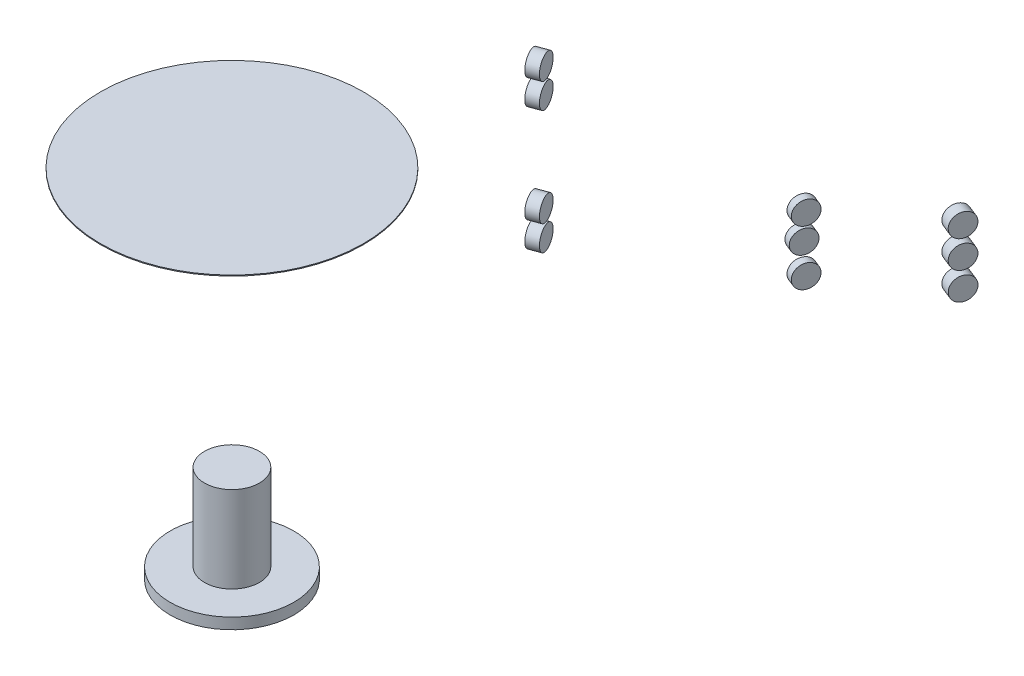
ISO-10303-21;
HEADER;
FILE_DESCRIPTION(('STEP AP214'),'2;1');
FILE_NAME('part.step','',(''),(''),'','','');
FILE_SCHEMA(('AUTOMOTIVE_DESIGN { 1 0 10303 214 1 1 1 1 }'));
ENDSEC;
DATA;
#1=APPLICATION_CONTEXT('core data for automotive mechanical design processes');
#2=APPLICATION_PROTOCOL_DEFINITION('international standard','automotive_design',2000,#1);
#3=PRODUCT_CONTEXT('',#1,'mechanical');
#4=PRODUCT('Part','Part','',(#3));
#5=PRODUCT_RELATED_PRODUCT_CATEGORY('part','',(#4));
#6=PRODUCT_DEFINITION_FORMATION('','',#4);
#7=PRODUCT_DEFINITION_CONTEXT('part definition',#1,'design');
#8=PRODUCT_DEFINITION('design','',#6,#7);
#9=PRODUCT_DEFINITION_SHAPE('','',#8);
#10=(LENGTH_UNIT() NAMED_UNIT(*) SI_UNIT(.MILLI.,.METRE.));
#11=(NAMED_UNIT(*) PLANE_ANGLE_UNIT() SI_UNIT($,.RADIAN.));
#12=(NAMED_UNIT(*) SI_UNIT($,.STERADIAN.) SOLID_ANGLE_UNIT());
#13=UNCERTAINTY_MEASURE_WITH_UNIT(LENGTH_MEASURE(1.E-05),#10,'distance_accuracy_value','');
#14=(GEOMETRIC_REPRESENTATION_CONTEXT(3) GLOBAL_UNCERTAINTY_ASSIGNED_CONTEXT((#13)) GLOBAL_UNIT_ASSIGNED_CONTEXT((#10,
#11,#12)) REPRESENTATION_CONTEXT('',''));
#15=CARTESIAN_POINT('',(0.,0.,0.));
#16=DIRECTION('',(0.,0.,1.));
#17=DIRECTION('',(1.,0.,0.));
#18=AXIS2_PLACEMENT_3D('',#15,#16,#17);
#19=CARTESIAN_POINT('',(562.010357181863,0.,680.173515638492));
#20=DIRECTION('',(0.92880687950673,0.,0.37056413828239));
#21=DIRECTION('',(0.343581086096886,-0.374606593415913,-0.8611747426892));
#22=AXIS2_PLACEMENT_3D('',#19,#20,#21);
#23=CYLINDRICAL_SURFACE('',#22,25.);
#24=CARTESIAN_POINT('',(562.010357181863,0.,680.173515638492));
#25=DIRECTION('',(-0.92880687950673,0.,-0.37056413828239));
#26=DIRECTION('',(0.138815769484069,0.927183854566787,-0.34793718107328));
#27=AXIS2_PLACEMENT_3D('',#24,#25,#26);
#28=CIRCLE('',#27,25.);
#29=CARTESIAN_POINT('',(565.480751418965,23.1795963641697,671.47508611166));
#30=VERTEX_POINT('',#29);
#31=EDGE_CURVE('E27',#30,#30,#28,.T.);
#32=ORIENTED_EDGE('',*,*,#31,.F.);
#33=EDGE_LOOP('',(#32));
#34=FACE_BOUND('',#33,.T.);
#35=CARTESIAN_POINT('',(585.230529169531,0.,689.437619095551));
#36=DIRECTION('',(-0.92880687950673,0.,-0.37056413828239));
#37=DIRECTION('',(0.138815769484069,0.927183854566787,-0.34793718107328));
#38=AXIS2_PLACEMENT_3D('',#35,#36,#37);
#39=CIRCLE('',#38,25.);
#40=CARTESIAN_POINT('',(588.700923406633,23.1795963641697,680.739189568719));
#41=VERTEX_POINT('',#40);
#42=EDGE_CURVE('E34',#41,#41,#39,.T.);
#43=ORIENTED_EDGE('',*,*,#42,.T.);
#44=EDGE_LOOP('',(#43));
#45=FACE_BOUND('',#44,.T.);
#46=ADVANCED_FACE('F132',(#34,#45),#23,.T.);
#47=CARTESIAN_POINT('',(562.010357181863,0.,680.173515638492));
#48=DIRECTION('',(-0.92880687950673,0.,-0.37056413828239));
#49=DIRECTION('',(-0.343581086096886,0.374606593415913,0.8611747426892));
#50=AXIS2_PLACEMENT_3D('',#47,#48,#49);
#51=PLANE('',#50);
#52=ORIENTED_EDGE('',*,*,#31,.T.);
#53=EDGE_LOOP('',(#52));
#54=FACE_BOUND('',#53,.T.);
#55=ADVANCED_FACE('F276',(#54),#51,.T.);
#56=CARTESIAN_POINT('',(585.230529169531,0.,689.437619095551));
#57=DIRECTION('',(-0.92880687950673,0.,-0.37056413828239));
#58=DIRECTION('',(-0.343581086096886,0.374606593415913,0.8611747426892));
#59=AXIS2_PLACEMENT_3D('',#56,#57,#58);
#60=PLANE('',#59);
#61=ORIENTED_EDGE('',*,*,#42,.F.);
#62=EDGE_LOOP('',(#61));
#63=FACE_BOUND('',#62,.T.);
#64=ADVANCED_FACE('F274',(#63),#60,.F.);
#65=CLOSED_SHELL('',(#46,#55,#64));
#66=MANIFOLD_SOLID_BREP('B1',#65);
#67=CARTESIAN_POINT('',(562.010357181863,60.,680.173515638492));
#68=DIRECTION('',(0.92880687950673,0.,0.37056413828239));
#69=DIRECTION('',(0.343581086096886,-0.374606593415913,-0.8611747426892));
#70=AXIS2_PLACEMENT_3D('',#67,#68,#69);
#71=CYLINDRICAL_SURFACE('',#70,25.);
#72=CARTESIAN_POINT('',(562.010357181863,60.,680.173515638492));
#73=DIRECTION('',(-0.92880687950673,0.,-0.37056413828239));
#74=DIRECTION('',(0.138815769484069,0.927183854566787,-0.34793718107328));
#75=AXIS2_PLACEMENT_3D('',#72,#73,#74);
#76=CIRCLE('',#75,25.);
#77=CARTESIAN_POINT('',(565.480751418965,83.1795963641697,671.47508611166));
#78=VERTEX_POINT('',#77);
#79=EDGE_CURVE('E40',#78,#78,#76,.T.);
#80=ORIENTED_EDGE('',*,*,#79,.F.);
#81=EDGE_LOOP('',(#80));
#82=FACE_BOUND('',#81,.T.);
#83=CARTESIAN_POINT('',(585.230529169531,60.,689.437619095551));
#84=DIRECTION('',(-0.92880687950673,0.,-0.37056413828239));
#85=DIRECTION('',(0.138815769484069,0.927183854566787,-0.34793718107328));
#86=AXIS2_PLACEMENT_3D('',#83,#84,#85);
#87=CIRCLE('',#86,25.);
#88=CARTESIAN_POINT('',(588.700923406633,83.1795963641697,680.739189568719));
#89=VERTEX_POINT('',#88);
#90=EDGE_CURVE('E44',#89,#89,#87,.T.);
#91=ORIENTED_EDGE('',*,*,#90,.T.);
#92=EDGE_LOOP('',(#91));
#93=FACE_BOUND('',#92,.T.);
#94=ADVANCED_FACE('F115',(#82,#93),#71,.T.);
#95=CARTESIAN_POINT('',(562.010357181863,60.,680.173515638492));
#96=DIRECTION('',(-0.92880687950673,0.,-0.37056413828239));
#97=DIRECTION('',(-0.343581086096886,0.374606593415913,0.8611747426892));
#98=AXIS2_PLACEMENT_3D('',#95,#96,#97);
#99=PLANE('',#98);
#100=ORIENTED_EDGE('',*,*,#79,.T.);
#101=EDGE_LOOP('',(#100));
#102=FACE_BOUND('',#101,.T.);
#103=ADVANCED_FACE('F119',(#102),#99,.T.);
#104=CARTESIAN_POINT('',(585.230529169531,60.,689.437619095551));
#105=DIRECTION('',(-0.92880687950673,0.,-0.37056413828239));
#106=DIRECTION('',(-0.343581086096886,0.374606593415913,0.8611747426892));
#107=AXIS2_PLACEMENT_3D('',#104,#105,#106);
#108=PLANE('',#107);
#109=ORIENTED_EDGE('',*,*,#90,.F.);
#110=EDGE_LOOP('',(#109));
#111=FACE_BOUND('',#110,.T.);
#112=ADVANCED_FACE('F117',(#111),#108,.F.);
#113=CLOSED_SHELL('',(#94,#103,#112));
#114=MANIFOLD_SOLID_BREP('B1',#113);
#115=CARTESIAN_POINT('',(-68.4638892147964,107.,945.432590987949));
#116=DIRECTION('',(-0.939692620785909,0.,0.342020143325668));
#117=DIRECTION('',(-0.32139380484327,-0.342020143325668,-0.883022221559489));
#118=AXIS2_PLACEMENT_3D('',#115,#116,#117);
#119=CYLINDRICAL_SURFACE('',#118,25.);
#120=CARTESIAN_POINT('',(-68.4638892147964,107.,945.432590987949));
#121=DIRECTION('',(0.939692620785909,0.,-0.342020143325668));
#122=DIRECTION('',(0.116977778440511,-0.939692620785909,0.32139380484327));
#123=AXIS2_PLACEMENT_3D('',#120,#121,#122);
#124=CIRCLE('',#123,25.);
#125=CARTESIAN_POINT('',(-65.5394447537836,83.5076844803523,953.467436109031));
#126=VERTEX_POINT('',#125);
#127=EDGE_CURVE('E48',#126,#126,#124,.T.);
#128=ORIENTED_EDGE('',*,*,#127,.F.);
#129=EDGE_LOOP('',(#128));
#130=FACE_BOUND('',#129,.T.);
#131=CARTESIAN_POINT('',(-91.9562047344441,107.,953.98309457109));
#132=DIRECTION('',(0.939692620785909,0.,-0.342020143325668));
#133=DIRECTION('',(0.116977778440511,-0.939692620785909,0.32139380484327));
#134=AXIS2_PLACEMENT_3D('',#131,#132,#133);
#135=CIRCLE('',#134,25.);
#136=CARTESIAN_POINT('',(-89.0317602734313,83.5076844803523,962.017939692172));
#137=VERTEX_POINT('',#136);
#138=EDGE_CURVE('E51',#137,#137,#135,.T.);
#139=ORIENTED_EDGE('',*,*,#138,.T.);
#140=EDGE_LOOP('',(#139));
#141=FACE_BOUND('',#140,.T.);
#142=ADVANCED_FACE('F256',(#130,#141),#119,.T.);
#143=CARTESIAN_POINT('',(-68.4638892147964,107.,945.432590987949));
#144=DIRECTION('',(0.939692620785909,0.,-0.342020143325668));
#145=DIRECTION('',(0.32139380484327,0.342020143325668,0.883022221559489));
#146=AXIS2_PLACEMENT_3D('',#143,#144,#145);
#147=PLANE('',#146);
#148=ORIENTED_EDGE('',*,*,#127,.T.);
#149=EDGE_LOOP('',(#148));
#150=FACE_BOUND('',#149,.T.);
#151=ADVANCED_FACE('F250',(#150),#147,.T.);
#152=CARTESIAN_POINT('',(-91.9562047344441,107.,953.98309457109));
#153=DIRECTION('',(0.939692620785909,0.,-0.342020143325668));
#154=DIRECTION('',(0.32139380484327,0.342020143325668,0.883022221559489));
#155=AXIS2_PLACEMENT_3D('',#152,#153,#154);
#156=PLANE('',#155);
#157=ORIENTED_EDGE('',*,*,#138,.F.);
#158=EDGE_LOOP('',(#157));
#159=FACE_BOUND('',#158,.T.);
#160=ADVANCED_FACE('F247',(#159),#156,.F.);
#161=CLOSED_SHELL('',(#142,#151,#160));
#162=MANIFOLD_SOLID_BREP('B1',#161);
#163=CARTESIAN_POINT('',(-68.4638892147964,-162.,945.432590987949));
#164=DIRECTION('',(-0.939692620785909,0.,0.342020143325668));
#165=DIRECTION('',(-0.32139380484327,-0.342020143325668,-0.883022221559489));
#166=AXIS2_PLACEMENT_3D('',#163,#164,#165);
#167=CYLINDRICAL_SURFACE('',#166,25.);
#168=CARTESIAN_POINT('',(-68.4638892147964,-162.,945.432590987949));
#169=DIRECTION('',(0.939692620785909,0.,-0.342020143325668));
#170=DIRECTION('',(0.116977778440511,-0.939692620785909,0.32139380484327));
#171=AXIS2_PLACEMENT_3D('',#168,#169,#170);
#172=CIRCLE('',#171,25.);
#173=CARTESIAN_POINT('',(-65.5394447537836,-185.492315519648,953.467436109031));
#174=VERTEX_POINT('',#173);
#175=EDGE_CURVE('E62',#174,#174,#172,.T.);
#176=ORIENTED_EDGE('',*,*,#175,.F.);
#177=EDGE_LOOP('',(#176));
#178=FACE_BOUND('',#177,.T.);
#179=CARTESIAN_POINT('',(-91.9562047344441,-162.,953.98309457109));
#180=DIRECTION('',(0.939692620785909,0.,-0.342020143325668));
#181=DIRECTION('',(0.116977778440511,-0.939692620785909,0.32139380484327));
#182=AXIS2_PLACEMENT_3D('',#179,#180,#181);
#183=CIRCLE('',#182,25.);
#184=CARTESIAN_POINT('',(-89.0317602734313,-185.492315519648,962.017939692172));
#185=VERTEX_POINT('',#184);
#186=EDGE_CURVE('E65',#185,#185,#183,.T.);
#187=ORIENTED_EDGE('',*,*,#186,.T.);
#188=EDGE_LOOP('',(#187));
#189=FACE_BOUND('',#188,.T.);
#190=ADVANCED_FACE('F228',(#178,#189),#167,.T.);
#191=CARTESIAN_POINT('',(-68.4638892147964,-162.,945.432590987949));
#192=DIRECTION('',(0.939692620785909,0.,-0.342020143325668));
#193=DIRECTION('',(0.32139380484327,0.342020143325668,0.883022221559489));
#194=AXIS2_PLACEMENT_3D('',#191,#192,#193);
#195=PLANE('',#194);
#196=ORIENTED_EDGE('',*,*,#175,.T.);
#197=EDGE_LOOP('',(#196));
#198=FACE_BOUND('',#197,.T.);
#199=ADVANCED_FACE('F222',(#198),#195,.T.);
#200=CARTESIAN_POINT('',(-91.9562047344441,-162.,953.98309457109));
#201=DIRECTION('',(0.939692620785909,0.,-0.342020143325668));
#202=DIRECTION('',(0.32139380484327,0.342020143325668,0.883022221559489));
#203=AXIS2_PLACEMENT_3D('',#200,#201,#202);
#204=PLANE('',#203);
#205=ORIENTED_EDGE('',*,*,#186,.F.);
#206=EDGE_LOOP('',(#205));
#207=FACE_BOUND('',#206,.T.);
#208=ADVANCED_FACE('F219',(#207),#204,.F.);
#209=CLOSED_SHELL('',(#190,#199,#208));
#210=MANIFOLD_SOLID_BREP('B1',#209);
#211=CARTESIAN_POINT('',(0.,379.,1700.));
#212=DIRECTION('',(0.,1.,0.));
#213=DIRECTION('',(0.954045007663232,0.,0.299663350032772));
#214=AXIS2_PLACEMENT_3D('',#211,#212,#213);
#215=CYLINDRICAL_SURFACE('',#214,287.);
#216=CARTESIAN_POINT('',(0.,379.,1700.));
#217=DIRECTION('',(0.,1.,0.));
#218=DIRECTION('',(-0.954045007663232,0.,-0.299663350032772));
#219=AXIS2_PLACEMENT_3D('',#216,#217,#218);
#220=CIRCLE('',#219,287.);
#221=CARTESIAN_POINT('',(-273.810917199348,379.,1613.99661854059));
#222=VERTEX_POINT('',#221);
#223=EDGE_CURVE('E69',#222,#222,#220,.T.);
#224=ORIENTED_EDGE('',*,*,#223,.T.);
#225=EDGE_LOOP('',(#224));
#226=FACE_BOUND('',#225,.T.);
#227=CARTESIAN_POINT('',(0.,381.,1700.));
#228=DIRECTION('',(0.,1.,0.));
#229=DIRECTION('',(-0.954045007663232,0.,-0.299663350032772));
#230=AXIS2_PLACEMENT_3D('',#227,#228,#229);
#231=CIRCLE('',#230,287.);
#232=CARTESIAN_POINT('',(-273.810917199348,381.,1613.99661854059));
#233=VERTEX_POINT('',#232);
#234=EDGE_CURVE('E93',#233,#233,#231,.T.);
#235=ORIENTED_EDGE('',*,*,#234,.F.);
#236=EDGE_LOOP('',(#235));
#237=FACE_BOUND('',#236,.T.);
#238=ADVANCED_FACE('F145',(#226,#237),#215,.T.);
#239=CARTESIAN_POINT('',(0.,379.,1700.));
#240=DIRECTION('',(0.,1.,0.));
#241=DIRECTION('',(0.954045007663232,0.,0.299663350032772));
#242=AXIS2_PLACEMENT_3D('',#239,#240,#241);
#243=PLANE('',#242);
#244=ORIENTED_EDGE('',*,*,#223,.F.);
#245=EDGE_LOOP('',(#244));
#246=FACE_BOUND('',#245,.T.);
#247=ADVANCED_FACE('F141',(#246),#243,.F.);
#248=CARTESIAN_POINT('',(0.,381.,1700.));
#249=DIRECTION('',(0.,1.,0.));
#250=DIRECTION('',(0.954045007663232,0.,0.299663350032772));
#251=AXIS2_PLACEMENT_3D('',#248,#249,#250);
#252=PLANE('',#251);
#253=ORIENTED_EDGE('',*,*,#234,.T.);
#254=EDGE_LOOP('',(#253));
#255=FACE_BOUND('',#254,.T.);
#256=ADVANCED_FACE('F144',(#255),#252,.T.);
#257=CLOSED_SHELL('',(#238,#247,#256));
#258=MANIFOLD_SOLID_BREP('B1',#257);
#259=CARTESIAN_POINT('',(-1.38111744263369E-13,-373.,1700.));
#260=DIRECTION('',(0.,-1.,0.));
#261=DIRECTION('',(-0.58081664993969,0.,-0.814034409071777));
#262=AXIS2_PLACEMENT_3D('',#259,#260,#261);
#263=CYLINDRICAL_SURFACE('',#262,135.);
#264=CARTESIAN_POINT('',(-1.38111744263369E-13,-373.,1700.));
#265=DIRECTION('',(0.,1.,0.));
#266=DIRECTION('',(0.814034409071776,0.,-0.580816649939689));
#267=AXIS2_PLACEMENT_3D('',#264,#265,#266);
#268=CIRCLE('',#267,135.);
#269=CARTESIAN_POINT('',(109.89464522469,-373.,1621.58975225814));
#270=VERTEX_POINT('',#269);
#271=EDGE_CURVE('E94',#270,#270,#268,.T.);
#272=ORIENTED_EDGE('',*,*,#271,.F.);
#273=EDGE_LOOP('',(#272));
#274=FACE_BOUND('',#273,.T.);
#275=CARTESIAN_POINT('',(-1.38777878078145E-13,-397.,1700.));
#276=DIRECTION('',(0.,1.,0.));
#277=DIRECTION('',(0.814034409071776,0.,-0.580816649939689));
#278=AXIS2_PLACEMENT_3D('',#275,#276,#277);
#279=CIRCLE('',#278,135.);
#280=CARTESIAN_POINT('',(109.89464522469,-397.,1621.58975225814));
#281=VERTEX_POINT('',#280);
#282=EDGE_CURVE('E95',#281,#281,#279,.T.);
#283=ORIENTED_EDGE('',*,*,#282,.T.);
#284=EDGE_LOOP('',(#283));
#285=FACE_BOUND('',#284,.T.);
#286=ADVANCED_FACE('F169',(#274,#285),#263,.T.);
#287=CARTESIAN_POINT('',(-1.38111744263369E-13,-373.,1700.));
#288=DIRECTION('',(0.,1.,0.));
#289=DIRECTION('',(0.58081664993969,0.,0.814034409071777));
#290=AXIS2_PLACEMENT_3D('',#287,#288,#289);
#291=PLANE('',#290);
#292=CARTESIAN_POINT('',(-1.38111744263369E-13,-373.,1700.));
#293=DIRECTION('',(0.,1.,0.));
#294=DIRECTION('',(0.58081664993969,0.,0.814034409071777));
#295=AXIS2_PLACEMENT_3D('',#292,#293,#294);
#296=CIRCLE('',#295,60.);
#297=CARTESIAN_POINT('',(34.8489989963813,-373.,1748.84206454431));
#298=VERTEX_POINT('',#297);
#299=EDGE_CURVE('E89',#298,#298,#296,.T.);
#300=ORIENTED_EDGE('',*,*,#299,.F.);
#301=EDGE_LOOP('',(#300));
#302=FACE_BOUND('',#301,.T.);
#303=ORIENTED_EDGE('',*,*,#271,.T.);
#304=EDGE_LOOP('',(#303));
#305=FACE_BOUND('',#304,.T.);
#306=ADVANCED_FACE('F166',(#302,#305),#291,.T.);
#307=CARTESIAN_POINT('',(-1.38777878078145E-13,-397.,1700.));
#308=DIRECTION('',(0.,1.,0.));
#309=DIRECTION('',(0.58081664993969,0.,0.814034409071777));
#310=AXIS2_PLACEMENT_3D('',#307,#308,#309);
#311=PLANE('',#310);
#312=ORIENTED_EDGE('',*,*,#282,.F.);
#313=EDGE_LOOP('',(#312));
#314=FACE_BOUND('',#313,.T.);
#315=ADVANCED_FACE('F164',(#314),#311,.F.);
#316=CARTESIAN_POINT('',(-1.32893696047631E-13,-185.,1700.));
#317=DIRECTION('',(0.,-1.,0.));
#318=DIRECTION('',(-0.58081664993969,0.,-0.814034409071777));
#319=AXIS2_PLACEMENT_3D('',#316,#317,#318);
#320=CYLINDRICAL_SURFACE('',#319,60.);
#321=CARTESIAN_POINT('',(-1.32893696047631E-13,-185.,1700.));
#322=DIRECTION('',(0.,-1.,0.));
#323=DIRECTION('',(0.58081664993969,0.,0.814034409071777));
#324=AXIS2_PLACEMENT_3D('',#321,#322,#323);
#325=CIRCLE('',#324,60.);
#326=CARTESIAN_POINT('',(34.8489989963813,-185.,1748.84206454431));
#327=VERTEX_POINT('',#326);
#328=EDGE_CURVE('E86',#327,#327,#325,.T.);
#329=ORIENTED_EDGE('',*,*,#328,.T.);
#330=EDGE_LOOP('',(#329));
#331=FACE_BOUND('',#330,.T.);
#332=ORIENTED_EDGE('',*,*,#299,.T.);
#333=EDGE_LOOP('',(#332));
#334=FACE_BOUND('',#333,.T.);
#335=ADVANCED_FACE('F158',(#331,#334),#320,.T.);
#336=CARTESIAN_POINT('',(-1.32893696047631E-13,-185.,1700.));
#337=DIRECTION('',(0.,-1.,0.));
#338=DIRECTION('',(-0.58081664993969,0.,-0.814034409071777));
#339=AXIS2_PLACEMENT_3D('',#336,#337,#338);
#340=PLANE('',#339);
#341=ORIENTED_EDGE('',*,*,#328,.F.);
#342=EDGE_LOOP('',(#341));
#343=FACE_BOUND('',#342,.T.);
#344=ADVANCED_FACE('F155',(#343),#340,.F.);
#345=CLOSED_SHELL('',(#286,#306,#315,#335,#344));
#346=MANIFOLD_SOLID_BREP('B1',#345);
#347=CARTESIAN_POINT('',(374.855505838593,-60.,830.928343144373));
#348=DIRECTION('',(0.927183854566787,0.,0.374606593415913));
#349=DIRECTION('',(0.33917459827458,-0.424526628652424,-0.839486589202165));
#350=AXIS2_PLACEMENT_3D('',#347,#348,#349);
#351=CYLINDRICAL_SURFACE('',#350,25.);
#352=CARTESIAN_POINT('',(390.617631366228,-60.,837.296655232444));
#353=DIRECTION('',(-0.927183854566787,0.,-0.374606593415913));
#354=DIRECTION('',(-0.33917459827458,0.424526628652424,0.839486589202165));
#355=AXIS2_PLACEMENT_3D('',#352,#353,#354);
#356=CIRCLE('',#355,25.);
#357=CARTESIAN_POINT('',(382.138266409363,-49.3868342836894,858.283819962498));
#358=VERTEX_POINT('',#357);
#359=EDGE_CURVE('E80',#358,#358,#356,.T.);
#360=ORIENTED_EDGE('',*,*,#359,.T.);
#361=EDGE_LOOP('',(#360));
#362=FACE_BOUND('',#361,.T.);
#363=CARTESIAN_POINT('',(374.855505838593,-60.,830.928343144373));
#364=DIRECTION('',(-0.927183854566787,0.,-0.374606593415913));
#365=DIRECTION('',(0.159030474173827,0.905415452466439,-0.393614235920197));
#366=AXIS2_PLACEMENT_3D('',#363,#364,#365);
#367=CIRCLE('',#366,25.);
#368=CARTESIAN_POINT('',(378.831267692939,-37.364613688339,821.087987246368));
#369=VERTEX_POINT('',#368);
#370=EDGE_CURVE('E83',#369,#369,#367,.T.);
#371=ORIENTED_EDGE('',*,*,#370,.F.);
#372=EDGE_LOOP('',(#371));
#373=FACE_BOUND('',#372,.T.);
#374=ADVANCED_FACE('F186',(#362,#373),#351,.T.);
#375=CARTESIAN_POINT('',(374.855505838593,-60.,830.928343144373));
#376=DIRECTION('',(-0.927183854566787,0.,-0.374606593415913));
#377=DIRECTION('',(-0.33917459827458,0.424526628652424,0.839486589202165));
#378=AXIS2_PLACEMENT_3D('',#375,#376,#377);
#379=PLANE('',#378);
#380=ORIENTED_EDGE('',*,*,#370,.T.);
#381=EDGE_LOOP('',(#380));
#382=FACE_BOUND('',#381,.T.);
#383=ADVANCED_FACE('F180',(#382),#379,.T.);
#384=CARTESIAN_POINT('',(390.617631366228,-60.,837.296655232444));
#385=DIRECTION('',(-0.927183854566787,0.,-0.374606593415913));
#386=DIRECTION('',(-0.33917459827458,0.424526628652424,0.839486589202165));
#387=AXIS2_PLACEMENT_3D('',#384,#385,#386);
#388=PLANE('',#387);
#389=ORIENTED_EDGE('',*,*,#359,.F.);
#390=EDGE_LOOP('',(#389));
#391=FACE_BOUND('',#390,.T.);
#392=ADVANCED_FACE('F177',(#391),#388,.F.);
#393=CLOSED_SHELL('',(#374,#383,#392));
#394=MANIFOLD_SOLID_BREP('B1',#393);
#395=CARTESIAN_POINT('',(367.438035002059,0.,827.931490397046));
#396=DIRECTION('',(0.927183854566787,0.,0.374606593415913));
#397=DIRECTION('',(0.347329185229499,-0.374606593415913,-0.859669900169325));
#398=AXIS2_PLACEMENT_3D('',#395,#396,#397);
#399=CYLINDRICAL_SURFACE('',#398,25.);
#400=CARTESIAN_POINT('',(383.200160529694,0.,834.299802485116));
#401=DIRECTION('',(-0.927183854566787,0.,-0.374606593415913));
#402=DIRECTION('',(-0.347329185229499,0.374606593415913,0.859669900169325));
#403=AXIS2_PLACEMENT_3D('',#400,#401,#402);
#404=CIRCLE('',#403,25.);
#405=CARTESIAN_POINT('',(374.516930898957,9.36516483539781,855.791549989349));
#406=VERTEX_POINT('',#405);
#407=EDGE_CURVE('E73',#406,#406,#404,.T.);
#408=ORIENTED_EDGE('',*,*,#407,.T.);
#409=EDGE_LOOP('',(#408));
#410=FACE_BOUND('',#409,.T.);
#411=CARTESIAN_POINT('',(367.438035002059,0.,827.931490397046));
#412=DIRECTION('',(-0.927183854566787,0.,-0.374606593415913));
#413=DIRECTION('',(0.140330099830675,0.927183854566787,-0.347329185229499));
#414=AXIS2_PLACEMENT_3D('',#411,#412,#413);
#415=CIRCLE('',#414,25.);
#416=CARTESIAN_POINT('',(370.946287497825,23.1795963641697,819.248260766308));
#417=VERTEX_POINT('',#416);
#418=EDGE_CURVE('E77',#417,#417,#415,.T.);
#419=ORIENTED_EDGE('',*,*,#418,.F.);
#420=EDGE_LOOP('',(#419));
#421=FACE_BOUND('',#420,.T.);
#422=ADVANCED_FACE('F200',(#410,#421),#399,.T.);
#423=CARTESIAN_POINT('',(367.438035002059,0.,827.931490397046));
#424=DIRECTION('',(-0.927183854566787,0.,-0.374606593415913));
#425=DIRECTION('',(-0.347329185229499,0.374606593415913,0.859669900169325));
#426=AXIS2_PLACEMENT_3D('',#423,#424,#425);
#427=PLANE('',#426);
#428=ORIENTED_EDGE('',*,*,#418,.T.);
#429=EDGE_LOOP('',(#428));
#430=FACE_BOUND('',#429,.T.);
#431=ADVANCED_FACE('F194',(#430),#427,.T.);
#432=CARTESIAN_POINT('',(383.200160529694,0.,834.299802485116));
#433=DIRECTION('',(-0.927183854566787,0.,-0.374606593415913));
#434=DIRECTION('',(-0.347329185229499,0.374606593415913,0.859669900169325));
#435=AXIS2_PLACEMENT_3D('',#432,#433,#434);
#436=PLANE('',#435);
#437=ORIENTED_EDGE('',*,*,#407,.F.);
#438=EDGE_LOOP('',(#437));
#439=FACE_BOUND('',#438,.T.);
#440=ADVANCED_FACE('F191',(#439),#436,.F.);
#441=CLOSED_SHELL('',(#422,#431,#440));
#442=MANIFOLD_SOLID_BREP('B1',#441);
#443=CARTESIAN_POINT('',(374.855505838593,60.,830.928343144373));
#444=DIRECTION('',(0.927183854566787,0.,0.374606593415913));
#445=DIRECTION('',(0.347329185229499,-0.374606593415913,-0.859669900169325));
#446=AXIS2_PLACEMENT_3D('',#443,#444,#445);
#447=CYLINDRICAL_SURFACE('',#446,25.);
#448=CARTESIAN_POINT('',(390.617631366228,60.,837.296655232444));
#449=DIRECTION('',(-0.927183854566787,0.,-0.374606593415913));
#450=DIRECTION('',(-0.347329185229499,0.374606593415913,0.859669900169325));
#451=AXIS2_PLACEMENT_3D('',#448,#449,#450);
#452=CIRCLE('',#451,25.);
#453=CARTESIAN_POINT('',(381.934401735491,69.3651648353978,858.788402736677));
#454=VERTEX_POINT('',#453);
#455=EDGE_CURVE('E74',#454,#454,#452,.T.);
#456=ORIENTED_EDGE('',*,*,#455,.T.);
#457=EDGE_LOOP('',(#456));
#458=FACE_BOUND('',#457,.T.);
#459=CARTESIAN_POINT('',(374.855505838593,60.,830.928343144373));
#460=DIRECTION('',(-0.927183854566787,0.,-0.374606593415913));
#461=DIRECTION('',(0.140330099830675,0.927183854566787,-0.347329185229499));
#462=AXIS2_PLACEMENT_3D('',#459,#460,#461);
#463=CIRCLE('',#462,25.);
#464=CARTESIAN_POINT('',(378.36375833436,83.1795963641697,822.245113513635));
#465=VERTEX_POINT('',#464);
#466=EDGE_CURVE('E70',#465,#465,#463,.T.);
#467=ORIENTED_EDGE('',*,*,#466,.F.);
#468=EDGE_LOOP('',(#467));
#469=FACE_BOUND('',#468,.T.);
#470=ADVANCED_FACE('F214',(#458,#469),#447,.T.);
#471=CARTESIAN_POINT('',(374.855505838593,60.,830.928343144373));
#472=DIRECTION('',(-0.927183854566787,0.,-0.374606593415913));
#473=DIRECTION('',(-0.347329185229499,0.374606593415913,0.859669900169325));
#474=AXIS2_PLACEMENT_3D('',#471,#472,#473);
#475=PLANE('',#474);
#476=ORIENTED_EDGE('',*,*,#466,.T.);
#477=EDGE_LOOP('',(#476));
#478=FACE_BOUND('',#477,.T.);
#479=ADVANCED_FACE('F208',(#478),#475,.T.);
#480=CARTESIAN_POINT('',(390.617631366228,60.,837.296655232444));
#481=DIRECTION('',(-0.927183854566787,0.,-0.374606593415913));
#482=DIRECTION('',(-0.347329185229499,0.374606593415913,0.859669900169325));
#483=AXIS2_PLACEMENT_3D('',#480,#481,#482);
#484=PLANE('',#483);
#485=ORIENTED_EDGE('',*,*,#455,.F.);
#486=EDGE_LOOP('',(#485));
#487=FACE_BOUND('',#486,.T.);
#488=ADVANCED_FACE('F205',(#487),#484,.F.);
#489=CLOSED_SHELL('',(#470,#479,#488));
#490=MANIFOLD_SOLID_BREP('B1',#489);
#491=CARTESIAN_POINT('',(-68.4638892147964,-107.,945.432590987949));
#492=DIRECTION('',(-0.939692620785909,0.,0.342020143325668));
#493=DIRECTION('',(-0.32139380484327,-0.342020143325668,-0.883022221559489));
#494=AXIS2_PLACEMENT_3D('',#491,#492,#493);
#495=CYLINDRICAL_SURFACE('',#494,25.);
#496=CARTESIAN_POINT('',(-68.4638892147964,-107.,945.432590987949));
#497=DIRECTION('',(0.939692620785909,0.,-0.342020143325668));
#498=DIRECTION('',(0.116977778440511,-0.939692620785909,0.32139380484327));
#499=AXIS2_PLACEMENT_3D('',#496,#497,#498);
#500=CIRCLE('',#499,25.);
#501=CARTESIAN_POINT('',(-65.5394447537836,-130.492315519648,953.467436109031));
#502=VERTEX_POINT('',#501);
#503=EDGE_CURVE('E55',#502,#502,#500,.T.);
#504=ORIENTED_EDGE('',*,*,#503,.F.);
#505=EDGE_LOOP('',(#504));
#506=FACE_BOUND('',#505,.T.);
#507=CARTESIAN_POINT('',(-91.9562047344441,-107.,953.98309457109));
#508=DIRECTION('',(0.939692620785909,0.,-0.342020143325668));
#509=DIRECTION('',(0.116977778440511,-0.939692620785909,0.32139380484327));
#510=AXIS2_PLACEMENT_3D('',#507,#508,#509);
#511=CIRCLE('',#510,25.);
#512=CARTESIAN_POINT('',(-89.0317602734313,-130.492315519648,962.017939692172));
#513=VERTEX_POINT('',#512);
#514=EDGE_CURVE('E58',#513,#513,#511,.T.);
#515=ORIENTED_EDGE('',*,*,#514,.T.);
#516=EDGE_LOOP('',(#515));
#517=FACE_BOUND('',#516,.T.);
#518=ADVANCED_FACE('F242',(#506,#517),#495,.T.);
#519=CARTESIAN_POINT('',(-68.4638892147964,-107.,945.432590987949));
#520=DIRECTION('',(0.939692620785909,0.,-0.342020143325668));
#521=DIRECTION('',(0.32139380484327,0.342020143325668,0.883022221559489));
#522=AXIS2_PLACEMENT_3D('',#519,#520,#521);
#523=PLANE('',#522);
#524=ORIENTED_EDGE('',*,*,#503,.T.);
#525=EDGE_LOOP('',(#524));
#526=FACE_BOUND('',#525,.T.);
#527=ADVANCED_FACE('F236',(#526),#523,.T.);
#528=CARTESIAN_POINT('',(-91.9562047344441,-107.,953.98309457109));
#529=DIRECTION('',(0.939692620785909,0.,-0.342020143325668));
#530=DIRECTION('',(0.32139380484327,0.342020143325668,0.883022221559489));
#531=AXIS2_PLACEMENT_3D('',#528,#529,#530);
#532=PLANE('',#531);
#533=ORIENTED_EDGE('',*,*,#514,.F.);
#534=EDGE_LOOP('',(#533));
#535=FACE_BOUND('',#534,.T.);
#536=ADVANCED_FACE('F233',(#535),#532,.F.);
#537=CLOSED_SHELL('',(#518,#527,#536));
#538=MANIFOLD_SOLID_BREP('B1',#537);
#539=CARTESIAN_POINT('',(-68.4638892147964,162.,945.432590987949));
#540=DIRECTION('',(-0.939692620785909,0.,0.342020143325668));
#541=DIRECTION('',(-0.32139380484327,-0.342020143325668,-0.883022221559489));
#542=AXIS2_PLACEMENT_3D('',#539,#540,#541);
#543=CYLINDRICAL_SURFACE('',#542,25.);
#544=CARTESIAN_POINT('',(-68.4638892147964,162.,945.432590987949));
#545=DIRECTION('',(0.939692620785909,0.,-0.342020143325668));
#546=DIRECTION('',(0.116977778440511,-0.939692620785909,0.32139380484327));
#547=AXIS2_PLACEMENT_3D('',#544,#545,#546);
#548=CIRCLE('',#547,25.);
#549=CARTESIAN_POINT('',(-65.5394447537836,138.507684480352,953.467436109031));
#550=VERTEX_POINT('',#549);
#551=EDGE_CURVE('E41',#550,#550,#548,.T.);
#552=ORIENTED_EDGE('',*,*,#551,.F.);
#553=EDGE_LOOP('',(#552));
#554=FACE_BOUND('',#553,.T.);
#555=CARTESIAN_POINT('',(-91.9562047344441,162.,953.98309457109));
#556=DIRECTION('',(0.939692620785909,0.,-0.342020143325668));
#557=DIRECTION('',(0.116977778440511,-0.939692620785909,0.32139380484327));
#558=AXIS2_PLACEMENT_3D('',#555,#556,#557);
#559=CIRCLE('',#558,25.);
#560=CARTESIAN_POINT('',(-89.0317602734313,138.507684480352,962.017939692172));
#561=VERTEX_POINT('',#560);
#562=EDGE_CURVE('E45',#561,#561,#559,.T.);
#563=ORIENTED_EDGE('',*,*,#562,.T.);
#564=EDGE_LOOP('',(#563));
#565=FACE_BOUND('',#564,.T.);
#566=ADVANCED_FACE('F269',(#554,#565),#543,.T.);
#567=CARTESIAN_POINT('',(-68.4638892147964,162.,945.432590987949));
#568=DIRECTION('',(0.939692620785909,0.,-0.342020143325668));
#569=DIRECTION('',(0.32139380484327,0.342020143325668,0.883022221559489));
#570=AXIS2_PLACEMENT_3D('',#567,#568,#569);
#571=PLANE('',#570);
#572=ORIENTED_EDGE('',*,*,#551,.T.);
#573=EDGE_LOOP('',(#572));
#574=FACE_BOUND('',#573,.T.);
#575=ADVANCED_FACE('F263',(#574),#571,.T.);
#576=CARTESIAN_POINT('',(-91.9562047344441,162.,953.98309457109));
#577=DIRECTION('',(0.939692620785909,0.,-0.342020143325668));
#578=DIRECTION('',(0.32139380484327,0.342020143325668,0.883022221559489));
#579=AXIS2_PLACEMENT_3D('',#576,#577,#578);
#580=PLANE('',#579);
#581=ORIENTED_EDGE('',*,*,#562,.F.);
#582=EDGE_LOOP('',(#581));
#583=FACE_BOUND('',#582,.T.);
#584=ADVANCED_FACE('F260',(#583),#580,.F.);
#585=CLOSED_SHELL('',(#566,#575,#584));
#586=MANIFOLD_SOLID_BREP('B1',#585);
#587=CARTESIAN_POINT('',(562.050712496394,-60.,680.072366363945));
#588=DIRECTION('',(0.92880687950673,0.,0.37056413828239));
#589=DIRECTION('',(0.343581086096886,-0.374606593415913,-0.8611747426892));
#590=AXIS2_PLACEMENT_3D('',#587,#588,#589);
#591=CYLINDRICAL_SURFACE('',#590,25.);
#592=CARTESIAN_POINT('',(562.050712496394,-60.,680.072366363945));
#593=DIRECTION('',(-0.92880687950673,0.,-0.37056413828239));
#594=DIRECTION('',(0.138815769484069,0.927183854566787,-0.34793718107328));
#595=AXIS2_PLACEMENT_3D('',#592,#593,#594);
#596=CIRCLE('',#595,25.);
#597=CARTESIAN_POINT('',(565.521106733496,-36.8204036358303,671.373936837113));
#598=VERTEX_POINT('',#597);
#599=EDGE_CURVE('E10',#598,#598,#596,.T.);
#600=ORIENTED_EDGE('',*,*,#599,.F.);
#601=EDGE_LOOP('',(#600));
#602=FACE_BOUND('',#601,.T.);
#603=CARTESIAN_POINT('',(585.270884484062,-60.,689.336469821005));
#604=DIRECTION('',(-0.92880687950673,0.,-0.37056413828239));
#605=DIRECTION('',(0.138815769484069,0.927183854566787,-0.34793718107328));
#606=AXIS2_PLACEMENT_3D('',#603,#604,#605);
#607=CIRCLE('',#606,25.);
#608=CARTESIAN_POINT('',(588.741278721164,-36.8204036358303,680.638040294173));
#609=VERTEX_POINT('',#608);
#610=EDGE_CURVE('E22',#609,#609,#607,.T.);
#611=ORIENTED_EDGE('',*,*,#610,.T.);
#612=EDGE_LOOP('',(#611));
#613=FACE_BOUND('',#612,.T.);
#614=ADVANCED_FACE('F15',(#602,#613),#591,.T.);
#615=CARTESIAN_POINT('',(562.050712496394,-60.,680.072366363945));
#616=DIRECTION('',(-0.92880687950673,0.,-0.37056413828239));
#617=DIRECTION('',(-0.343581086096886,0.374606593415913,0.8611747426892));
#618=AXIS2_PLACEMENT_3D('',#615,#616,#617);
#619=PLANE('',#618);
#620=ORIENTED_EDGE('',*,*,#599,.T.);
#621=EDGE_LOOP('',(#620));
#622=FACE_BOUND('',#621,.T.);
#623=ADVANCED_FACE('F287',(#622),#619,.T.);
#624=CARTESIAN_POINT('',(585.270884484062,-60.,689.336469821005));
#625=DIRECTION('',(-0.92880687950673,0.,-0.37056413828239));
#626=DIRECTION('',(-0.343581086096886,0.374606593415913,0.8611747426892));
#627=AXIS2_PLACEMENT_3D('',#624,#625,#626);
#628=PLANE('',#627);
#629=ORIENTED_EDGE('',*,*,#610,.F.);
#630=EDGE_LOOP('',(#629));
#631=FACE_BOUND('',#630,.T.);
#632=ADVANCED_FACE('F285',(#631),#628,.F.);
#633=CLOSED_SHELL('',(#614,#623,#632));
#634=MANIFOLD_SOLID_BREP('B1',#633);
#635=ADVANCED_BREP_SHAPE_REPRESENTATION('',(#18,#66,#114,#162,#210,#258,#346,#394,#442,#490,
#538,#586,#634),#14);
#636=SHAPE_DEFINITION_REPRESENTATION(#9,#635);
ENDSEC;
END-ISO-10303-21;
